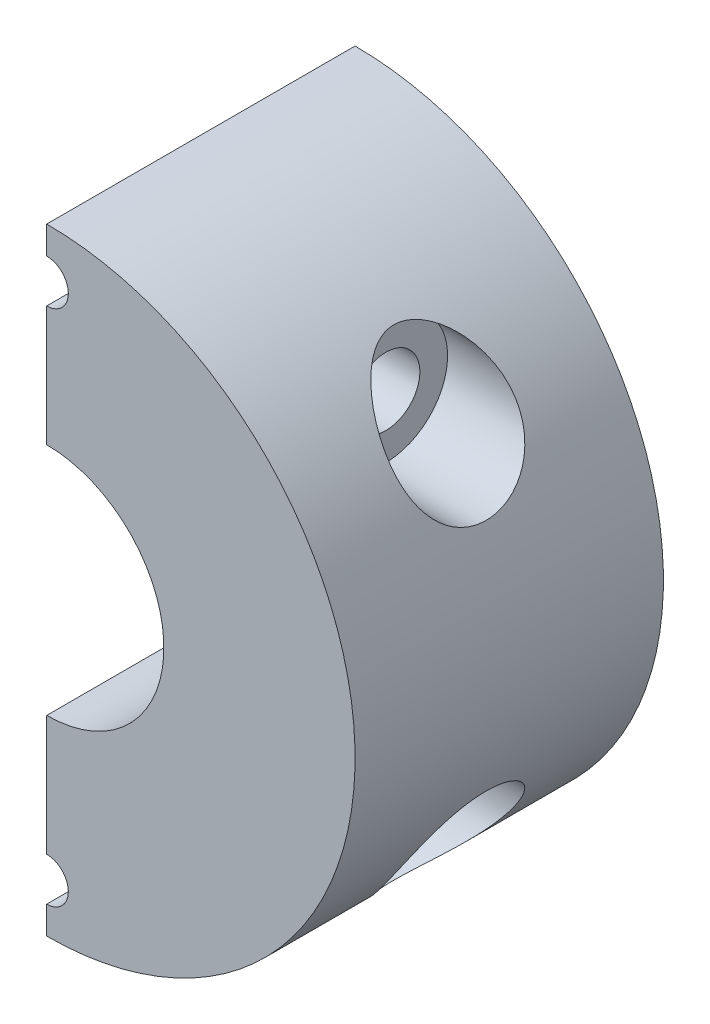
ISO-10303-21;
HEADER;
FILE_DESCRIPTION(('STEP AP214'),'2;1');
FILE_NAME('part.step','',(''),(''),'','','');
FILE_SCHEMA(('AUTOMOTIVE_DESIGN { 1 0 10303 214 1 1 1 1 }'));
ENDSEC;
DATA;
#1=APPLICATION_CONTEXT('core data for automotive mechanical design processes');
#2=APPLICATION_PROTOCOL_DEFINITION('international standard','automotive_design',2000,#1);
#3=PRODUCT_CONTEXT('',#1,'mechanical');
#4=PRODUCT('Part','Part','',(#3));
#5=PRODUCT_RELATED_PRODUCT_CATEGORY('part','',(#4));
#6=PRODUCT_DEFINITION_FORMATION('','',#4);
#7=PRODUCT_DEFINITION_CONTEXT('part definition',#1,'design');
#8=PRODUCT_DEFINITION('design','',#6,#7);
#9=PRODUCT_DEFINITION_SHAPE('','',#8);
#10=(LENGTH_UNIT() NAMED_UNIT(*) SI_UNIT(.MILLI.,.METRE.));
#11=(NAMED_UNIT(*) PLANE_ANGLE_UNIT() SI_UNIT($,.RADIAN.));
#12=(NAMED_UNIT(*) SI_UNIT($,.STERADIAN.) SOLID_ANGLE_UNIT());
#13=UNCERTAINTY_MEASURE_WITH_UNIT(LENGTH_MEASURE(1.E-05),#10,'distance_accuracy_value','');
#14=(GEOMETRIC_REPRESENTATION_CONTEXT(3) GLOBAL_UNCERTAINTY_ASSIGNED_CONTEXT((#13)) GLOBAL_UNIT_ASSIGNED_CONTEXT((#10,
#11,#12)) REPRESENTATION_CONTEXT('',''));
#15=CARTESIAN_POINT('',(0.,0.,0.));
#16=DIRECTION('',(0.,0.,1.));
#17=DIRECTION('',(1.,0.,0.));
#18=AXIS2_PLACEMENT_3D('',#15,#16,#17);
#19=CARTESIAN_POINT('',(0.,21.,0.));
#20=DIRECTION('',(0.,0.,1.));
#21=DIRECTION('',(1.,0.,0.));
#22=AXIS2_PLACEMENT_3D('',#19,#20,#21);
#23=CYLINDRICAL_SURFACE('',#22,1.75);
#24=CARTESIAN_POINT('',(0.,21.,5.));
#25=DIRECTION('',(0.,0.,-1.));
#26=DIRECTION('',(-1.,0.,0.));
#27=AXIS2_PLACEMENT_3D('',#24,#25,#26);
#28=CIRCLE('',#27,1.75);
#29=CARTESIAN_POINT('',(0.,19.25,5.));
#30=VERTEX_POINT('',#29);
#31=CARTESIAN_POINT('',(0.,22.75,5.));
#32=VERTEX_POINT('',#31);
#33=EDGE_CURVE('E249',#30,#32,#28,.F.);
#34=ORIENTED_EDGE('',*,*,#33,.F.);
#35=DIRECTION('',(0.,0.,1.));
#36=VECTOR('',#35,1.);
#37=CARTESIAN_POINT('',(0.,19.25,0.));
#38=LINE('',#37,#36);
#39=CARTESIAN_POINT('',(0.,19.25,25.));
#40=VERTEX_POINT('',#39);
#41=EDGE_CURVE('E226',#40,#30,#38,.F.);
#42=ORIENTED_EDGE('',*,*,#41,.F.);
#43=CARTESIAN_POINT('',(0.,21.,25.));
#44=DIRECTION('',(0.,0.,1.));
#45=DIRECTION('',(1.,0.,0.));
#46=AXIS2_PLACEMENT_3D('',#43,#44,#45);
#47=CIRCLE('',#46,1.75);
#48=CARTESIAN_POINT('',(0.,22.75,25.));
#49=VERTEX_POINT('',#48);
#50=EDGE_CURVE('E196',#40,#49,#47,.T.);
#51=ORIENTED_EDGE('',*,*,#50,.T.);
#52=DIRECTION('',(0.,0.,1.));
#53=VECTOR('',#52,1.);
#54=CARTESIAN_POINT('',(0.,22.75,0.));
#55=LINE('',#54,#53);
#56=EDGE_CURVE('E229',#32,#49,#55,.T.);
#57=ORIENTED_EDGE('',*,*,#56,.F.);
#58=EDGE_LOOP('',(#34,#42,#51,#57));
#59=FACE_BOUND('',#58,.T.);
#60=ADVANCED_FACE('F33',(#59),#23,.F.);
#61=CARTESIAN_POINT('',(0.,25.,0.));
#62=DIRECTION('',(1.,0.,0.));
#63=DIRECTION('',(0.,0.,-1.));
#64=AXIS2_PLACEMENT_3D('',#61,#62,#63);
#65=PLANE('',#64);
#66=CARTESIAN_POINT('',(0.,-14.5,12.5));
#67=DIRECTION('',(-1.,0.,0.));
#68=DIRECTION('',(0.,0.,1.));
#69=AXIS2_PLACEMENT_3D('',#66,#67,#68);
#70=CIRCLE('',#69,2.75);
#71=CARTESIAN_POINT('',(0.,-14.5,15.25));
#72=VERTEX_POINT('',#71);
#73=EDGE_CURVE('E181',#72,#72,#70,.T.);
#74=ORIENTED_EDGE('',*,*,#73,.F.);
#75=EDGE_LOOP('',(#74));
#76=FACE_BOUND('',#75,.T.);
#77=DIRECTION('',(0.,1.,0.));
#78=VECTOR('',#77,1.);
#79=CARTESIAN_POINT('',(0.,25.,0.));
#80=LINE('',#79,#78);
#81=CARTESIAN_POINT('',(0.,-17.5,0.));
#82=VERTEX_POINT('',#81);
#83=CARTESIAN_POINT('',(0.,-6.,0.));
#84=VERTEX_POINT('',#83);
#85=EDGE_CURVE('E157',#82,#84,#80,.T.);
#86=ORIENTED_EDGE('',*,*,#85,.F.);
#87=DIRECTION('',(0.,0.,-1.));
#88=VECTOR('',#87,1.);
#89=CARTESIAN_POINT('',(0.,-17.5,5.));
#90=LINE('',#89,#88);
#91=CARTESIAN_POINT('',(0.,-17.5,5.));
#92=VERTEX_POINT('',#91);
#93=EDGE_CURVE('E140',#82,#92,#90,.F.);
#94=ORIENTED_EDGE('',*,*,#93,.T.);
#95=DIRECTION('',(0.,-1.,0.));
#96=VECTOR('',#95,1.);
#97=CARTESIAN_POINT('',(0.,25.,5.));
#98=LINE('',#97,#96);
#99=CARTESIAN_POINT('',(0.,-19.25,5.));
#100=VERTEX_POINT('',#99);
#101=EDGE_CURVE('E212',#92,#100,#98,.T.);
#102=ORIENTED_EDGE('',*,*,#101,.T.);
#103=DIRECTION('',(0.,0.,1.));
#104=VECTOR('',#103,1.);
#105=CARTESIAN_POINT('',(0.,-19.25,0.));
#106=LINE('',#105,#104);
#107=CARTESIAN_POINT('',(0.,-19.25,25.));
#108=VERTEX_POINT('',#107);
#109=EDGE_CURVE('E245',#100,#108,#106,.T.);
#110=ORIENTED_EDGE('',*,*,#109,.T.);
#111=DIRECTION('',(0.,1.,0.));
#112=VECTOR('',#111,1.);
#113=CARTESIAN_POINT('',(0.,25.,25.));
#114=LINE('',#113,#112);
#115=CARTESIAN_POINT('',(0.,-9.5,25.));
#116=VERTEX_POINT('',#115);
#117=EDGE_CURVE('E172',#108,#116,#114,.T.);
#118=ORIENTED_EDGE('',*,*,#117,.T.);
#119=DIRECTION('',(0.,0.,1.));
#120=VECTOR('',#119,1.);
#121=CARTESIAN_POINT('',(0.,-9.5,5.));
#122=LINE('',#121,#120);
#123=CARTESIAN_POINT('',(0.,-9.5,5.));
#124=VERTEX_POINT('',#123);
#125=EDGE_CURVE('E486',#124,#116,#122,.T.);
#126=ORIENTED_EDGE('',*,*,#125,.F.);
#127=DIRECTION('',(0.,1.,0.));
#128=VECTOR('',#127,1.);
#129=CARTESIAN_POINT('',(0.,0.,5.));
#130=LINE('',#129,#128);
#131=CARTESIAN_POINT('',(0.,-6.,5.));
#132=VERTEX_POINT('',#131);
#133=EDGE_CURVE('E485',#124,#132,#130,.T.);
#134=ORIENTED_EDGE('',*,*,#133,.T.);
#135=DIRECTION('',(0.,0.,1.));
#136=VECTOR('',#135,1.);
#137=CARTESIAN_POINT('',(0.,-6.,-15.));
#138=LINE('',#137,#136);
#139=EDGE_CURVE('E235',#84,#132,#138,.T.);
#140=ORIENTED_EDGE('',*,*,#139,.F.);
#141=EDGE_LOOP('',(#86,#94,#102,#110,#118,#126,#134,#140));
#142=FACE_BOUND('',#141,.T.);
#143=ADVANCED_FACE('F299',(#76,#142),#65,.F.);
#144=CARTESIAN_POINT('',(0.,24.5,0.));
#145=VERTEX_POINT('',#144);
#146=CARTESIAN_POINT('',(0.,25.,0.));
#147=VERTEX_POINT('',#146);
#148=EDGE_CURVE('E163',#145,#147,#80,.T.);
#149=ORIENTED_EDGE('',*,*,#148,.F.);
#150=DIRECTION('',(0.,0.,-1.));
#151=VECTOR('',#150,1.);
#152=CARTESIAN_POINT('',(0.,24.5,5.));
#153=LINE('',#152,#151);
#154=CARTESIAN_POINT('',(0.,24.5,5.));
#155=VERTEX_POINT('',#154);
#156=EDGE_CURVE('E206',#145,#155,#153,.F.);
#157=ORIENTED_EDGE('',*,*,#156,.T.);
#158=DIRECTION('',(0.,1.,0.));
#159=VECTOR('',#158,1.);
#160=CARTESIAN_POINT('',(0.,25.,5.));
#161=LINE('',#160,#159);
#162=EDGE_CURVE('E209',#32,#155,#161,.T.);
#163=ORIENTED_EDGE('',*,*,#162,.F.);
#164=ORIENTED_EDGE('',*,*,#56,.T.);
#165=CARTESIAN_POINT('',(0.,25.,25.));
#166=VERTEX_POINT('',#165);
#167=EDGE_CURVE('E175',#49,#166,#114,.T.);
#168=ORIENTED_EDGE('',*,*,#167,.T.);
#169=DIRECTION('',(0.,0.,1.));
#170=VECTOR('',#169,1.);
#171=CARTESIAN_POINT('',(0.,25.,0.));
#172=LINE('',#171,#170);
#173=EDGE_CURVE('E156',#147,#166,#172,.T.);
#174=ORIENTED_EDGE('',*,*,#173,.F.);
#175=EDGE_LOOP('',(#149,#157,#163,#164,#168,#174));
#176=FACE_BOUND('',#175,.T.);
#177=ADVANCED_FACE('F251',(#176),#65,.F.);
#178=CARTESIAN_POINT('',(0.,0.,25.));
#179=DIRECTION('',(0.,0.,-1.));
#180=DIRECTION('',(-1.,0.,0.));
#181=AXIS2_PLACEMENT_3D('',#178,#179,#180);
#182=CYLINDRICAL_SURFACE('',#181,25.);
#183=CARTESIAN_POINT('',(20.3654118544163,14.5,17.5));
#184=CARTESIAN_POINT('',(20.242620103465,14.6724612822737,17.5000000653577));
#185=CARTESIAN_POINT('',(20.1175978881926,14.843408011226,17.4910758490451));
#186=CARTESIAN_POINT('',(19.8640534899469,15.1810412450875,17.4563109312045));
#187=CARTESIAN_POINT('',(19.7355289095989,15.3477246723567,17.4304583484866));
#188=CARTESIAN_POINT('',(19.4755389864491,15.6763330071527,17.3625591032278));
#189=CARTESIAN_POINT('',(19.3440652077939,15.8382400276103,17.3204582750635));
#190=CARTESIAN_POINT('',(19.0795941657325,16.1558594337865,17.2207873676544));
#191=CARTESIAN_POINT('',(18.9465971850649,16.3115729458979,17.1632201161412));
#192=CARTESIAN_POINT('',(18.6759075974207,16.6208908751804,17.0311126550394));
#193=CARTESIAN_POINT('',(18.5381978203011,16.7742783417187,16.9560994152901));
#194=CARTESIAN_POINT('',(18.2633947279486,17.0730669886588,16.7905138293489));
#195=CARTESIAN_POINT('',(18.1263015383728,17.2184666033719,16.6999384471001));
#196=CARTESIAN_POINT('',(17.8543561014628,17.5002931078029,16.5034625189679));
#197=CARTESIAN_POINT('',(17.7195010302117,17.6367320684608,16.397583231579));
#198=CARTESIAN_POINT('',(17.4535840407378,17.8999262806936,16.1702498553025));
#199=CARTESIAN_POINT('',(17.3225205635373,18.0266855484253,16.048802282424));
#200=CARTESIAN_POINT('',(17.107558346254,18.2303534138596,15.8315070380605));
#201=CARTESIAN_POINT('',(17.0220465346346,18.3101839992513,15.7399868668634));
#202=CARTESIAN_POINT('',(16.8546463463967,18.4643952568398,15.5493626540083));
#203=CARTESIAN_POINT('',(16.7727586765405,18.5387748678533,15.4502571432904));
#204=CARTESIAN_POINT('',(16.534265118929,18.7526875028186,15.1414556186223));
#205=CARTESIAN_POINT('',(16.3844218362518,18.8833763244251,14.9198747184233));
#206=CARTESIAN_POINT('',(16.1506640280272,19.0833230434094,14.5076787271961));
#207=CARTESIAN_POINT('',(16.0598069619284,19.159679115729,14.3244554899301));
#208=CARTESIAN_POINT('',(15.9006513914191,19.2919671664351,13.94148742213));
#209=CARTESIAN_POINT('',(15.8323175521316,19.3479311510208,13.7417690910481));
#210=CARTESIAN_POINT('',(15.7338167975318,19.4280829493581,13.3631638115392));
#211=CARTESIAN_POINT('',(15.6992293840184,19.4559760211531,13.1862293900877));
#212=CARTESIAN_POINT('',(15.6538356562987,19.4925196174792,12.8273951150641));
#213=CARTESIAN_POINT('',(15.6430114202075,19.50118464361,12.6454991083551));
#214=CARTESIAN_POINT('',(15.6462926088762,19.4985519371359,12.2819175173892));
#215=CARTESIAN_POINT('',(15.6604208286188,19.4872359511466,12.1002322774185));
#216=CARTESIAN_POINT('',(15.7121227854543,19.4455716423479,11.7424719763767));
#217=CARTESIAN_POINT('',(15.7497155466459,19.4152078762703,11.5664015894681));
#218=CARTESIAN_POINT('',(15.8572827852613,19.327505987429,11.1793600601289));
#219=CARTESIAN_POINT('',(15.9331220698859,19.2652185970709,10.9711593031344));
#220=CARTESIAN_POINT('',(16.1085427568584,19.1187847793872,10.5733405151265));
#221=CARTESIAN_POINT('',(16.2081713270784,19.0345948951286,10.3837604715947));
#222=CARTESIAN_POINT('',(16.4728799582761,18.8065566365564,9.9426530231433));
#223=CARTESIAN_POINT('',(16.647216828863,18.6529247641317,9.70173589454555));
#224=CARTESIAN_POINT('',(16.92359885645,18.4012949426208,9.36962684580795));
#225=CARTESIAN_POINT('',(17.0183444608446,18.3137546713544,9.26367771683618));
#226=CARTESIAN_POINT('',(17.2116543523714,18.1321940918762,9.0611558420719));
#227=CARTESIAN_POINT('',(17.3102185546913,18.0381739275488,8.96458288819828));
#228=CARTESIAN_POINT('',(17.5446487650671,17.810683065989,8.74876433987725));
#229=CARTESIAN_POINT('',(17.6816184682799,17.6748207032266,8.63323965057165));
#230=CARTESIAN_POINT('',(17.9584487341707,17.3934785116365,8.41844325456193));
#231=CARTESIAN_POINT('',(18.0983101973051,17.2479956551423,8.31917669895699));
#232=CARTESIAN_POINT('',(18.3793398989252,16.9482182211285,8.13685692954982));
#233=CARTESIAN_POINT('',(18.5205088153,16.7939188301327,8.05381268393962));
#234=CARTESIAN_POINT('',(18.8026799255918,16.477383852695,7.90428633266718));
#235=CARTESIAN_POINT('',(18.9436821365017,16.315149162404,7.83780236195936));
#236=CARTESIAN_POINT('',(19.2254247628275,15.9822080271571,7.72146474981612));
#237=CARTESIAN_POINT('',(19.3661541879252,15.8114444916228,7.67174750274144));
#238=CARTESIAN_POINT('',(19.6450479887721,15.4635631778839,7.59047348439134));
#239=CARTESIAN_POINT('',(19.7832121143204,15.2864447847618,7.5589184756179));
#240=CARTESIAN_POINT('',(20.0556062769372,14.9272698047635,7.51500994663268));
#241=CARTESIAN_POINT('',(20.1898417889937,14.7452208449726,7.5026283202129));
#242=CARTESIAN_POINT('',(20.4534126484517,14.3773798074809,7.49812325331996));
#243=CARTESIAN_POINT('',(20.5827495011275,14.1915889069398,7.505993537685));
#244=CARTESIAN_POINT('',(20.8054910335264,13.8622229376346,7.53877197754548));
#245=CARTESIAN_POINT('',(20.9001627578857,13.7190497622933,7.55921309625781));
#246=CARTESIAN_POINT('',(21.0854460082269,13.4325368681083,7.61310314717218));
#247=CARTESIAN_POINT('',(21.1760583911485,13.289197191031,7.64654931939844));
#248=CARTESIAN_POINT('',(21.352718519671,13.0034469223382,7.72691318697205));
#249=CARTESIAN_POINT('',(21.438765842307,12.8610364178813,7.77383212803323));
#250=CARTESIAN_POINT('',(21.6057301248615,12.5785266078964,7.88147480251725));
#251=CARTESIAN_POINT('',(21.6866496523292,12.4384261721069,7.94219155623385));
#252=CARTESIAN_POINT('',(21.8435486068727,12.1607982297298,8.07821069923306));
#253=CARTESIAN_POINT('',(21.9194824584775,12.0233009508381,8.15362779547267));
#254=CARTESIAN_POINT('',(22.0651790973477,11.7537793540694,8.31870488751859));
#255=CARTESIAN_POINT('',(22.1349449340929,11.6217523490282,8.4083577831161));
#256=CARTESIAN_POINT('',(22.2679190402953,11.3648887903474,8.60167881173974));
#257=CARTESIAN_POINT('',(22.3311289763411,11.2400504128795,8.70534336732426));
#258=CARTESIAN_POINT('',(22.4506624769467,10.9993550251621,8.92618588406788));
#259=CARTESIAN_POINT('',(22.5069872188467,10.8834964806409,9.04336152820799));
#260=CARTESIAN_POINT('',(22.6055254038911,10.6771496561979,9.27408734014332));
#261=CARTESIAN_POINT('',(22.6486201562659,10.5853310822094,9.38607512739105));
#262=CARTESIAN_POINT('',(22.7293058343104,10.4109503219156,9.61888620384471));
#263=CARTESIAN_POINT('',(22.7668974566218,10.3283869643021,9.73970837179689));
#264=CARTESIAN_POINT('',(22.836482889516,10.1736056462083,9.98925089500947));
#265=CARTESIAN_POINT('',(22.8684792685734,10.1013829416659,10.1179675894711));
#266=CARTESIAN_POINT('',(22.9268505503403,9.96819021721853,10.3823128152437));
#267=CARTESIAN_POINT('',(22.953225846624,9.90721940952392,10.5179408618147));
#268=CARTESIAN_POINT('',(22.9980728066099,9.80263054397983,10.7816110402454));
#269=CARTESIAN_POINT('',(23.0170605702284,9.75790768238272,10.9091286968258));
#270=CARTESIAN_POINT('',(23.0504328711058,9.67881138329842,11.167917699066));
#271=CARTESIAN_POINT('',(23.0648177250545,9.64443723380795,11.2991887858048));
#272=CARTESIAN_POINT('',(23.0889890622801,9.58642648120725,11.5644647427919));
#273=CARTESIAN_POINT('',(23.0987766386885,9.56278732559585,11.6984689552478));
#274=CARTESIAN_POINT('',(23.1137668491851,9.52649826561428,11.9682119128729));
#275=CARTESIAN_POINT('',(23.1189695342016,9.51384823917882,12.1039506387586));
#276=CARTESIAN_POINT('',(23.1246817127785,9.4999551570489,12.3707822033027));
#277=CARTESIAN_POINT('',(23.1253666664105,9.49828564653401,12.5018493024139));
#278=CARTESIAN_POINT('',(23.122508673669,9.50524104013825,12.7637091605465));
#279=CARTESIAN_POINT('',(23.1189643127029,9.51386938861599,12.8945018131119));
#280=CARTESIAN_POINT('',(23.1076442225258,9.54133104298121,13.1547653346803));
#281=CARTESIAN_POINT('',(23.0998704129937,9.56015971908715,13.2842367762199));
#282=CARTESIAN_POINT('',(23.0800823347369,9.60783350449831,13.5410420382977));
#283=CARTESIAN_POINT('',(23.0680665003661,9.63668231196906,13.6683750513832));
#284=CARTESIAN_POINT('',(23.039871581725,9.70389797631732,13.9192129030645));
#285=CARTESIAN_POINT('',(23.0237175515949,9.74220750600672,14.0427359346601));
#286=CARTESIAN_POINT('',(22.9872023656078,9.8280568860298,14.2859404338253));
#287=CARTESIAN_POINT('',(22.9668396925271,9.87560006473731,14.4056204979712));
#288=CARTESIAN_POINT('',(22.9219230798504,9.9794106721914,14.6402627653562));
#289=CARTESIAN_POINT('',(22.8973706732144,10.0356749093469,14.7552266751492));
#290=CARTESIAN_POINT('',(22.8440763143434,10.1564034256156,14.9798040475942));
#291=CARTESIAN_POINT('',(22.8153327997095,10.2208707616077,15.0894154944757));
#292=CARTESIAN_POINT('',(22.7530624707744,10.3587637038099,15.304789823554));
#293=CARTESIAN_POINT('',(22.7194494932694,10.4323461862573,15.410427317301));
#294=CARTESIAN_POINT('',(22.6479473171594,10.5866763087679,15.6148525988647));
#295=CARTESIAN_POINT('',(22.6100565707175,10.6674265400841,15.7136378863217));
#296=CARTESIAN_POINT('',(22.5301055696513,10.8352654327475,15.9037915506408));
#297=CARTESIAN_POINT('',(22.4880467282224,10.9223519431312,15.9951624223845));
#298=CARTESIAN_POINT('',(22.399845499838,11.1021147093449,16.1701662178363));
#299=CARTESIAN_POINT('',(22.3537015875534,11.1947930489655,16.2537962271308));
#300=CARTESIAN_POINT('',(22.2547890624386,11.3902151557258,16.417444052735));
#301=CARTESIAN_POINT('',(22.2017944408107,11.493232001806,16.496999686265));
#302=CARTESIAN_POINT('',(22.0916082196785,11.7036315962619,16.6469310549768));
#303=CARTESIAN_POINT('',(22.0344150682187,11.8110159524478,16.7173033686419));
#304=CARTESIAN_POINT('',(21.8568252016097,12.1383927073874,16.9144777789328));
#305=CARTESIAN_POINT('',(21.7303946865563,12.3636554757012,17.0273758770476));
#306=CARTESIAN_POINT('',(21.4495785877833,12.8452855219643,17.2261955098446));
#307=CARTESIAN_POINT('',(21.2936505970999,13.1024224439976,17.3080000967585));
#308=CARTESIAN_POINT('',(20.9679332191399,13.617580055577,17.4286118160402));
#309=CARTESIAN_POINT('',(20.798158681699,13.8755995212672,17.4674643781344));
#310=CARTESIAN_POINT('',(20.580767925929,14.1928736463883,17.4909442727506));
#311=CARTESIAN_POINT('',(20.5381014623803,14.2545441531627,17.4943510657389));
#312=CARTESIAN_POINT('',(20.4521872429737,14.3775398062722,17.498878531858));
#313=CARTESIAN_POINT('',(20.4089396883398,14.4388650622303,17.4999999768317));
#314=CARTESIAN_POINT('',(20.3654118544163,14.5,17.5));
#315=B_SPLINE_CURVE_WITH_KNOTS('',3,(#183,#184,#185,#186,#187,#188,#189,#190,#191,#192,#193,
#194,#195,#196,#197,#198,#199,#200,#201,#202,#203,#204,#205,#206,#207,#208,#209,#210,#211,#212,
#213,#214,#215,#216,#217,#218,#219,#220,#221,#222,#223,#224,#225,#226,#227,#228,#229,#230,#231,
#232,#233,#234,#235,#236,#237,#238,#239,#240,#241,#242,#243,#244,#245,#246,#247,#248,#249,#250,
#251,#252,#253,#254,#255,#256,#257,#258,#259,#260,#261,#262,#263,#264,#265,#266,#267,#268,#269,
#270,#271,#272,#273,#274,#275,#276,#277,#278,#279,#280,#281,#282,#283,#284,#285,#286,#287,#288,
#289,#290,#291,#292,#293,#294,#295,#296,#297,#298,#299,#300,#301,#302,#303,#304,#305,#306,#307,
#308,#309,#310,#311,#312,#313,#314),.UNSPECIFIED.,.T.,.F.,(4,2,2,2,2,2,2,2,2,2,2,2,2,2,2,2,2,2,
2,2,2,2,2,2,2,2,2,2,2,2,2,2,2,2,2,2,2,2,2,2,2,2,2,2,2,2,2,2,2,2,2,2,2,2,2,2,2,2,2,2,2,2,2,2,2,
4),(0.,0.635048423217999,1.27054303418833,1.90817470721101,2.54568988105144,3.20307228799824,
3.8605830912421,4.51718917751774,5.173521337248,5.6187830248981,6.0641311660786,
6.95278430959185,7.60556173121892,8.25731013376048,8.80221193436839,9.34670263561292,
9.89169100638015,10.4371218065801,11.1238066234677,11.8118644289495,12.8101591003705,
13.3106675498453,13.8111648892281,14.4848831622898,15.1588144797457,15.8331173192877,
16.5073441833568,17.1869304377811,17.8665826295773,18.545237574798,19.2236822605137,
19.7417604827578,20.2597288166722,20.7777450581997,21.2954998391201,21.8174692563372,
22.339179150527,22.8607560930529,23.3822437229127,23.8349088316998,24.2875165879233,
24.7399160277901,25.1922837813645,25.6011562834127,26.0100006481304,26.4187477493703,
26.8274903102619,27.2202595998438,27.6131602970811,28.0058828115894,28.3987504238801,
28.7892934836405,29.1799775812457,29.5705190387482,29.9612064598126,30.3599230338715,
30.7587843418526,31.1575108753285,31.5563869227821,31.9775272987276,32.398824137658,
33.2412252078224,34.1727371850547,35.1032629703052,35.3284541787073,35.5535693194643),.UNSPECIFIED.);
#316=CARTESIAN_POINT('',(20.3654118544163,14.5,17.5));
#317=VERTEX_POINT('',#316);
#318=EDGE_CURVE('E190',#317,#317,#315,.T.);
#319=ORIENTED_EDGE('',*,*,#318,.T.);
#320=EDGE_LOOP('',(#319));
#321=FACE_BOUND('',#320,.T.);
#322=CARTESIAN_POINT('',(20.3654118544163,-14.5,17.5));
#323=CARTESIAN_POINT('',(20.4892142698879,-14.326116274896,17.4999994158321));
#324=CARTESIAN_POINT('',(20.6108142363862,-14.1506028401532,17.490928721174));
#325=CARTESIAN_POINT('',(20.8486403673723,-13.7978072037332,17.4536254957486));
#326=CARTESIAN_POINT('',(20.9648633279923,-13.6205240221288,17.4253816939115));
#327=CARTESIAN_POINT('',(21.1909012738715,-13.2661178439004,17.3487534288791));
#328=CARTESIAN_POINT('',(21.3007146542959,-13.0889948982326,17.3003639460511));
#329=CARTESIAN_POINT('',(21.5128625574501,-12.737301901494,17.1826528754696));
#330=CARTESIAN_POINT('',(21.6152012896752,-12.5627304585041,17.1133431840097));
#331=CARTESIAN_POINT('',(21.7826413924718,-12.2693171250486,16.9768307714145));
#332=CARTESIAN_POINT('',(21.8498528066587,-12.1491636150805,16.9149859451968));
#333=CARTESIAN_POINT('',(21.979780391658,-11.9124916419966,16.7805733355605));
#334=CARTESIAN_POINT('',(22.0424975809512,-11.7959723586944,16.7080079931094));
#335=CARTESIAN_POINT('',(22.1631271391904,-11.5677333212955,16.5522696259378));
#336=CARTESIAN_POINT('',(22.2210421730204,-11.4560109220651,16.4691025503977));
#337=CARTESIAN_POINT('',(22.3318351547425,-11.2385065176405,16.2923979287831));
#338=CARTESIAN_POINT('',(22.384715422973,-11.1327217853112,16.1988652032865));
#339=CARTESIAN_POINT('',(22.4855342944351,-10.9276655802662,16.001258202498));
#340=CARTESIAN_POINT('',(22.5334446315832,-10.8284324181415,15.8971296626514));
#341=CARTESIAN_POINT('',(22.6238115291461,-10.6383376238649,15.6793774958029));
#342=CARTESIAN_POINT('',(22.6662703928191,-10.5474724608354,15.5657579124994));
#343=CARTESIAN_POINT('',(22.7456468486978,-10.3751892353203,15.3297154294766));
#344=CARTESIAN_POINT('',(22.7825634179986,-10.293772917374,15.2072909108397));
#345=CARTESIAN_POINT('',(22.8507677938986,-10.1414682729569,14.9545795382298));
#346=CARTESIAN_POINT('',(22.8820560793058,-10.0705790510172,14.8242933543229));
#347=CARTESIAN_POINT('',(22.9365188785745,-9.9458698308187,14.5684246766286));
#348=CARTESIAN_POINT('',(22.9601595820747,-9.89110650903417,14.4434000547123));
#349=CARTESIAN_POINT('',(23.0026963441151,-9.79177628578222,14.1885865897174));
#350=CARTESIAN_POINT('',(23.0215927172698,-9.74720870821391,14.0587980632059));
#351=CARTESIAN_POINT('',(23.0546386336626,-9.66878739381693,13.7954740479712));
#352=CARTESIAN_POINT('',(23.0687894885291,-9.63493069672182,13.6619396056689));
#353=CARTESIAN_POINT('',(23.0923592978472,-9.57830283445386,13.3921300340413));
#354=CARTESIAN_POINT('',(23.1017783632423,-9.55553140937123,13.2558549690517));
#355=CARTESIAN_POINT('',(23.1155520043124,-9.52216170798985,12.9882794545069));
#356=CARTESIAN_POINT('',(23.1201293381238,-9.51102831114438,12.8570568763706));
#357=CARTESIAN_POINT('',(23.1250121443685,-9.49915025896187,12.5940171751883));
#358=CARTESIAN_POINT('',(23.1253161939544,-9.49840906384796,12.4621998687325));
#359=CARTESIAN_POINT('',(23.1216498338638,-9.50733042176555,12.1990424388878));
#360=CARTESIAN_POINT('',(23.1176815007796,-9.51698792051067,12.0677021147816));
#361=CARTESIAN_POINT('',(23.105467326617,-9.54660335928079,11.8063397390005));
#362=CARTESIAN_POINT('',(23.0972199107382,-9.56656509148571,11.6763181906385));
#363=CARTESIAN_POINT('',(23.0765653374613,-9.61628026589872,11.4201384765238));
#364=CARTESIAN_POINT('',(23.064209612195,-9.64591256094721,11.2939526181776));
#365=CARTESIAN_POINT('',(23.0353036845578,-9.71474016059648,11.0446597649221));
#366=CARTESIAN_POINT('',(23.0187519711025,-9.75393891013618,10.9215538967824));
#367=CARTESIAN_POINT('',(22.981460525464,-9.84148020822065,10.6793493933429));
#368=CARTESIAN_POINT('',(22.9607224463289,-9.8898191471514,10.560249197932));
#369=CARTESIAN_POINT('',(22.9150509295666,-9.99518568474155,10.3267393642033));
#370=CARTESIAN_POINT('',(22.8901159304292,-10.0522165165657,10.2123314914923));
#371=CARTESIAN_POINT('',(22.8356898403383,-10.1752570637647,9.98737857206854));
#372=CARTESIAN_POINT('',(22.8061390991661,-10.2413827444138,9.87691141269861));
#373=CARTESIAN_POINT('',(22.7427718770144,-10.3813403756108,9.66220660001242));
#374=CARTESIAN_POINT('',(22.7089538545368,-10.455175109279,9.55797121799669));
#375=CARTESIAN_POINT('',(22.6371298444655,-10.6097885338985,9.35637368006142));
#376=CARTESIAN_POINT('',(22.5991250791261,-10.6905651967558,9.25900953173843));
#377=CARTESIAN_POINT('',(22.5189909057846,-10.8583468401774,9.07156109451986));
#378=CARTESIAN_POINT('',(22.4768599517925,-10.9453541519183,8.98147955750932));
#379=CARTESIAN_POINT('',(22.3865274142248,-11.1289860338346,8.80497281701997));
#380=CARTESIAN_POINT('',(22.3381341437418,-11.225870026437,8.71891522661018));
#381=CARTESIAN_POINT('',(22.2371152239679,-11.4246739810049,8.55551627548872));
#382=CARTESIAN_POINT('',(22.1844880354606,-11.526595769192,8.47817810943426));
#383=CARTESIAN_POINT('',(22.020541161654,-11.8385267079988,8.25961001738411));
#384=CARTESIAN_POINT('',(21.9030946299452,-12.0548279993252,8.13170646854457));
#385=CARTESIAN_POINT('',(21.6421975575324,-12.5176787400035,7.90180859536494));
#386=CARTESIAN_POINT('',(21.4973432668847,-12.7651676241053,7.80334419756547));
#387=CARTESIAN_POINT('',(21.1930704954333,-13.2642114104881,7.6480741720866));
#388=CARTESIAN_POINT('',(21.0336439732965,-13.5157684939205,7.59129170355005));
#389=CARTESIAN_POINT('',(20.6791162322041,-14.0531905985252,7.51156333443922));
#390=CARTESIAN_POINT('',(20.4821932588955,-14.3387444543876,7.49471345749868));
#391=CARTESIAN_POINT('',(20.077159214711,-14.9005942345336,7.50815110168993));
#392=CARTESIAN_POINT('',(19.8690452091604,-15.1768876992846,7.53845104590325));
#393=CARTESIAN_POINT('',(19.5333144866549,-15.6041737824435,7.6207861387905));
#394=CARTESIAN_POINT('',(19.4079195211662,-15.7598230743074,7.6586921143047));
#395=CARTESIAN_POINT('',(19.1555560603345,-16.0656125251668,7.74876319321921));
#396=CARTESIAN_POINT('',(19.0285878408234,-16.2157536321055,7.80092582990716));
#397=CARTESIAN_POINT('',(18.7736194391826,-16.5102776755094,7.91916625547382));
#398=CARTESIAN_POINT('',(18.6456174218446,-16.6546444407405,7.98528025692976));
#399=CARTESIAN_POINT('',(18.3899021844749,-16.9365789292695,8.1309892220642));
#400=CARTESIAN_POINT('',(18.2621888877167,-17.0741487304106,8.21058003250607));
#401=CARTESIAN_POINT('',(17.9917602933685,-17.3591451027683,8.39419881412654));
#402=CARTESIAN_POINT('',(17.849222985859,-17.5055711000308,8.50005204406085));
#403=CARTESIAN_POINT('',(17.5676044598199,-17.7881724488535,8.72892536195189));
#404=CARTESIAN_POINT('',(17.4285247864201,-17.9243432708952,8.85195296784117));
#405=CARTESIAN_POINT('',(17.1566619733438,-18.18472563519,9.11518562398023));
#406=CARTESIAN_POINT('',(17.0238603805969,-18.3089734959861,9.25533534782708));
#407=CARTESIAN_POINT('',(16.7673424149193,-18.5441758096165,9.55369977975767));
#408=CARTESIAN_POINT('',(16.6436161018728,-18.6551448934022,9.7118942230031));
#409=CARTESIAN_POINT('',(16.4083811514408,-18.8623907257041,10.0486793020225));
#410=CARTESIAN_POINT('',(16.2969819496771,-18.9585384562305,10.2274277119642));
#411=CARTESIAN_POINT('',(16.0937556109098,-19.1313567951947,10.6043826657106));
#412=CARTESIAN_POINT('',(16.0018965792696,-19.208059183359,10.8025567171467));
#413=CARTESIAN_POINT('',(15.8583033346393,-19.326703279213,11.1825452305694));
#414=CARTESIAN_POINT('',(15.8024420783367,-19.3722993236016,11.3616268283599));
#415=CARTESIAN_POINT('',(15.7143991984305,-19.4437890420052,11.7293395452356));
#416=CARTESIAN_POINT('',(15.6821954398221,-19.4697011339749,11.9179615607706));
#417=CARTESIAN_POINT('',(15.644846890325,-19.4997281593743,12.3007061630811));
#418=CARTESIAN_POINT('',(15.6398475773186,-19.5037259049724,12.4948527524648));
#419=CARTESIAN_POINT('',(15.6579321765388,-19.4892091277854,12.8809789138304));
#420=CARTESIAN_POINT('',(15.6810225809058,-19.4706894007266,13.0729579744978));
#421=CARTESIAN_POINT('',(15.7497051465378,-19.415161287606,13.4337501809374));
#422=CARTESIAN_POINT('',(15.7933661982023,-19.3797367551993,13.6031927026599));
#423=CARTESIAN_POINT('',(15.8985849576127,-19.2935128104109,13.9322052713237));
#424=CARTESIAN_POINT('',(15.9601506330522,-19.2427065526307,14.0917708845405));
#425=CARTESIAN_POINT('',(16.1366383876669,-19.0952453873172,14.4875356468387));
#426=CARTESIAN_POINT('',(16.261967582679,-18.9889661030568,14.7155521193323));
#427=CARTESIAN_POINT('',(16.4668608895743,-18.8109234610942,15.0359371387865));
#428=CARTESIAN_POINT('',(16.5381212135866,-18.7483402803291,15.1392947115296));
#429=CARTESIAN_POINT('',(16.6851993134617,-18.6175662813271,15.3389903681455));
#430=CARTESIAN_POINT('',(16.7610160053193,-18.5493767954759,15.4353301096592));
#431=CARTESIAN_POINT('',(16.9512050195422,-18.3760667485834,15.6630411223069));
#432=CARTESIAN_POINT('',(17.0675545672895,-18.2681519870695,15.7906331034403));
#433=CARTESIAN_POINT('',(17.3054659088588,-18.0429408549067,16.031970612161));
#434=CARTESIAN_POINT('',(17.4270300041463,-17.9256403216215,16.1457099389936));
#435=CARTESIAN_POINT('',(17.6736977947485,-17.6824894808723,16.3597960758739));
#436=CARTESIAN_POINT('',(17.7988053216611,-17.556629694739,16.4601276611705));
#437=CARTESIAN_POINT('',(18.0509884168681,-17.2972408063185,16.6474120494367));
#438=CARTESIAN_POINT('',(18.1780636697789,-17.1637129239551,16.7343669724576));
#439=CARTESIAN_POINT('',(18.4366751146001,-16.8856766773339,16.8971847475329));
#440=CARTESIAN_POINT('',(18.568235133282,-16.7409637149234,16.972660310061));
#441=CARTESIAN_POINT('',(18.8311479843063,-16.4446678509427,17.1092166102071));
#442=CARTESIAN_POINT('',(18.9625007781617,-16.2930838002151,17.1702949292837));
#443=CARTESIAN_POINT('',(19.2236067517328,-15.9841712261335,17.2774349418614));
#444=CARTESIAN_POINT('',(19.3533634571627,-15.8268605695718,17.3235395215529));
#445=CARTESIAN_POINT('',(19.6106858718282,-15.5068730081266,17.4003325262696));
#446=CARTESIAN_POINT('',(19.7382526383355,-15.3441988101911,17.4310286047003));
#447=CARTESIAN_POINT('',(19.9493313037849,-15.0679733702291,17.4689058074763));
#448=CARTESIAN_POINT('',(20.0336801913625,-14.9556492489713,17.4804876227257));
#449=CARTESIAN_POINT('',(20.2008119159111,-14.7291220134474,17.4960392455445));
#450=CARTESIAN_POINT('',(20.2835928638783,-14.614916908566,17.500000386067));
#451=CARTESIAN_POINT('',(20.3654118544163,-14.5,17.5));
#452=B_SPLINE_CURVE_WITH_KNOTS('',3,(#322,#323,#324,#325,#326,#327,#328,#329,#330,#331,#332,
#333,#334,#335,#336,#337,#338,#339,#340,#341,#342,#343,#344,#345,#346,#347,#348,#349,#350,#351,
#352,#353,#354,#355,#356,#357,#358,#359,#360,#361,#362,#363,#364,#365,#366,#367,#368,#369,#370,
#371,#372,#373,#374,#375,#376,#377,#378,#379,#380,#381,#382,#383,#384,#385,#386,#387,#388,#389,
#390,#391,#392,#393,#394,#395,#396,#397,#398,#399,#400,#401,#402,#403,#404,#405,#406,#407,#408,
#409,#410,#411,#412,#413,#414,#415,#416,#417,#418,#419,#420,#421,#422,#423,#424,#425,#426,#427,
#428,#429,#430,#431,#432,#433,#434,#435,#436,#437,#438,#439,#440,#441,#442,#443,#444,#445,#446,
#447,#448,#449,#450,#451),.UNSPECIFIED.,.T.,.F.,(4,2,2,2,2,2,2,2,2,2,2,2,2,2,2,2,2,2,2,2,2,2,2,
2,2,2,2,2,2,2,2,2,2,2,2,2,2,2,2,2,2,2,2,2,2,2,2,2,2,2,2,2,2,2,2,2,2,2,2,2,2,2,2,2,4),(0.,
0.640214281696645,1.28080524494261,1.92155591774025,2.56194291141289,3.01428010335431,
3.4665144603647,3.91849615330278,4.37026852586503,4.82448367359086,5.27850627856318,
5.73261257677258,6.18668022507609,6.60172903544915,7.0167503150932,7.43165679100477,
7.84655353838282,8.24139909533533,8.63637611829765,9.03116124925494,9.42609177333895,
9.81625344490114,10.2065558239262,10.5967043867116,10.9869984307248,11.3828327847255,
11.7788105401294,12.174673000825,12.570684353879,12.9852027010566,13.3998724309268,
14.2286630247144,15.1347666194183,16.0413732794173,17.0793634621014,18.1176271817773,
18.7274365871445,19.3371405489462,19.9484469831627,20.5595653687999,21.2491064820793,
21.9389503879913,22.6266214119532,23.3135276232002,24.0061113435367,24.6975557622437,
25.2743930156252,25.8506898646664,26.4300654992415,27.0095750654828,27.5430959355293,
28.0768545906624,28.9149617400891,29.3355573860414,29.7560533612357,30.366054384905,
30.9763274627597,31.5872877335876,32.1981510740667,32.8264444321204,33.4548432598296,
34.0814260888573,34.7076973853536,35.1303241550513,35.5534312976455),.UNSPECIFIED.);
#453=CARTESIAN_POINT('',(20.3654118544163,-14.5,17.5));
#454=VERTEX_POINT('',#453);
#455=EDGE_CURVE('E275',#454,#454,#452,.T.);
#456=ORIENTED_EDGE('',*,*,#455,.T.);
#457=EDGE_LOOP('',(#456));
#458=FACE_BOUND('',#457,.T.);
#459=CARTESIAN_POINT('',(0.,0.,25.));
#460=DIRECTION('',(0.,0.,1.));
#461=DIRECTION('',(1.,0.,0.));
#462=AXIS2_PLACEMENT_3D('',#459,#460,#461);
#463=CIRCLE('',#462,25.);
#464=CARTESIAN_POINT('',(0.,-25.,25.));
#465=VERTEX_POINT('',#464);
#466=EDGE_CURVE('E256',#465,#166,#463,.T.);
#467=ORIENTED_EDGE('',*,*,#466,.F.);
#468=DIRECTION('',(0.,0.,1.));
#469=VECTOR('',#468,1.);
#470=CARTESIAN_POINT('',(0.,-25.,0.));
#471=LINE('',#470,#469);
#472=CARTESIAN_POINT('',(0.,-25.,0.));
#473=VERTEX_POINT('',#472);
#474=EDGE_CURVE('E161',#473,#465,#471,.T.);
#475=ORIENTED_EDGE('',*,*,#474,.F.);
#476=CARTESIAN_POINT('',(0.,0.,0.));
#477=DIRECTION('',(0.,0.,1.));
#478=DIRECTION('',(1.,0.,0.));
#479=AXIS2_PLACEMENT_3D('',#476,#477,#478);
#480=CIRCLE('',#479,25.);
#481=EDGE_CURVE('E155',#473,#147,#480,.T.);
#482=ORIENTED_EDGE('',*,*,#481,.T.);
#483=ORIENTED_EDGE('',*,*,#173,.T.);
#484=EDGE_LOOP('',(#467,#475,#482,#483));
#485=FACE_BOUND('',#484,.T.);
#486=ADVANCED_FACE('F35',(#321,#458,#485),#182,.T.);
#487=CARTESIAN_POINT('',(0.,0.,25.));
#488=DIRECTION('',(0.,0.,1.));
#489=DIRECTION('',(1.,0.,0.));
#490=AXIS2_PLACEMENT_3D('',#487,#488,#489);
#491=PLANE('',#490);
#492=ORIENTED_EDGE('',*,*,#50,.F.);
#493=CARTESIAN_POINT('',(0.,9.5,25.));
#494=VERTEX_POINT('',#493);
#495=EDGE_CURVE('E173',#494,#40,#114,.T.);
#496=ORIENTED_EDGE('',*,*,#495,.F.);
#497=CARTESIAN_POINT('',(0.,0.,25.));
#498=DIRECTION('',(0.,0.,1.));
#499=DIRECTION('',(1.,0.,0.));
#500=AXIS2_PLACEMENT_3D('',#497,#498,#499);
#501=CIRCLE('',#500,9.5);
#502=EDGE_CURVE('E265',#116,#494,#501,.T.);
#503=ORIENTED_EDGE('',*,*,#502,.F.);
#504=ORIENTED_EDGE('',*,*,#117,.F.);
#505=CARTESIAN_POINT('',(0.,-21.,25.));
#506=DIRECTION('',(0.,0.,1.));
#507=DIRECTION('',(1.,0.,0.));
#508=AXIS2_PLACEMENT_3D('',#505,#506,#507);
#509=CIRCLE('',#508,1.75);
#510=CARTESIAN_POINT('',(0.,-22.75,25.));
#511=VERTEX_POINT('',#510);
#512=EDGE_CURVE('E200',#511,#108,#509,.T.);
#513=ORIENTED_EDGE('',*,*,#512,.F.);
#514=EDGE_CURVE('E168',#465,#511,#114,.T.);
#515=ORIENTED_EDGE('',*,*,#514,.F.);
#516=ORIENTED_EDGE('',*,*,#466,.T.);
#517=ORIENTED_EDGE('',*,*,#167,.F.);
#518=EDGE_LOOP('',(#492,#496,#503,#504,#513,#515,#516,#517));
#519=FACE_BOUND('',#518,.T.);
#520=ADVANCED_FACE('F254',(#519),#491,.T.);
#521=CARTESIAN_POINT('',(0.,0.,0.));
#522=DIRECTION('',(0.,0.,1.));
#523=DIRECTION('',(1.,0.,0.));
#524=AXIS2_PLACEMENT_3D('',#521,#522,#523);
#525=PLANE('',#524);
#526=CARTESIAN_POINT('',(0.,6.,0.));
#527=VERTEX_POINT('',#526);
#528=CARTESIAN_POINT('',(0.,17.5,0.));
#529=VERTEX_POINT('',#528);
#530=EDGE_CURVE('E159',#527,#529,#80,.T.);
#531=ORIENTED_EDGE('',*,*,#530,.T.);
#532=CARTESIAN_POINT('',(0.,21.,0.));
#533=DIRECTION('',(0.,0.,-1.));
#534=DIRECTION('',(-1.,0.,0.));
#535=AXIS2_PLACEMENT_3D('',#532,#533,#534);
#536=CIRCLE('',#535,3.5);
#537=EDGE_CURVE('E218',#145,#529,#536,.T.);
#538=ORIENTED_EDGE('',*,*,#537,.F.);
#539=ORIENTED_EDGE('',*,*,#148,.T.);
#540=ORIENTED_EDGE('',*,*,#481,.F.);
#541=CARTESIAN_POINT('',(0.,-24.5,0.));
#542=VERTEX_POINT('',#541);
#543=EDGE_CURVE('E148',#473,#542,#80,.T.);
#544=ORIENTED_EDGE('',*,*,#543,.T.);
#545=CARTESIAN_POINT('',(0.,-21.,0.));
#546=DIRECTION('',(0.,0.,-1.));
#547=DIRECTION('',(1.,0.,0.));
#548=AXIS2_PLACEMENT_3D('',#545,#546,#547);
#549=CIRCLE('',#548,3.5);
#550=EDGE_CURVE('E136',#82,#542,#549,.T.);
#551=ORIENTED_EDGE('',*,*,#550,.F.);
#552=ORIENTED_EDGE('',*,*,#85,.T.);
#553=CARTESIAN_POINT('',(0.,0.,0.));
#554=DIRECTION('',(0.,0.,1.));
#555=DIRECTION('',(1.,0.,0.));
#556=AXIS2_PLACEMENT_3D('',#553,#554,#555);
#557=CIRCLE('',#556,6.);
#558=EDGE_CURVE('E268',#84,#527,#557,.T.);
#559=ORIENTED_EDGE('',*,*,#558,.T.);
#560=EDGE_LOOP('',(#531,#538,#539,#540,#544,#551,#552,#559));
#561=FACE_BOUND('',#560,.T.);
#562=ADVANCED_FACE('F153',(#561),#525,.F.);
#563=CARTESIAN_POINT('',(0.,0.,5.));
#564=DIRECTION('',(0.,0.,1.));
#565=DIRECTION('',(1.,0.,0.));
#566=AXIS2_PLACEMENT_3D('',#563,#564,#565);
#567=CYLINDRICAL_SURFACE('',#566,9.5);
#568=ORIENTED_EDGE('',*,*,#502,.T.);
#569=DIRECTION('',(0.,0.,1.));
#570=VECTOR('',#569,1.);
#571=CARTESIAN_POINT('',(0.,9.5,5.));
#572=LINE('',#571,#570);
#573=CARTESIAN_POINT('',(0.,9.5,5.));
#574=VERTEX_POINT('',#573);
#575=EDGE_CURVE('E492',#494,#574,#572,.F.);
#576=ORIENTED_EDGE('',*,*,#575,.T.);
#577=CARTESIAN_POINT('',(0.,0.,5.));
#578=DIRECTION('',(0.,0.,1.));
#579=DIRECTION('',(1.,0.,0.));
#580=AXIS2_PLACEMENT_3D('',#577,#578,#579);
#581=CIRCLE('',#580,9.5);
#582=EDGE_CURVE('E262',#124,#574,#581,.T.);
#583=ORIENTED_EDGE('',*,*,#582,.F.);
#584=ORIENTED_EDGE('',*,*,#125,.T.);
#585=EDGE_LOOP('',(#568,#576,#583,#584));
#586=FACE_BOUND('',#585,.T.);
#587=ADVANCED_FACE('F307',(#586),#567,.F.);
#588=CARTESIAN_POINT('',(0.,0.,5.));
#589=DIRECTION('',(0.,0.,1.));
#590=DIRECTION('',(1.,0.,0.));
#591=AXIS2_PLACEMENT_3D('',#588,#589,#590);
#592=PLANE('',#591);
#593=ORIENTED_EDGE('',*,*,#133,.F.);
#594=ORIENTED_EDGE('',*,*,#582,.T.);
#595=CARTESIAN_POINT('',(0.,6.,5.));
#596=VERTEX_POINT('',#595);
#597=EDGE_CURVE('E488',#596,#574,#130,.T.);
#598=ORIENTED_EDGE('',*,*,#597,.F.);
#599=CARTESIAN_POINT('',(0.,0.,5.));
#600=DIRECTION('',(0.,0.,1.));
#601=DIRECTION('',(1.,0.,0.));
#602=AXIS2_PLACEMENT_3D('',#599,#600,#601);
#603=CIRCLE('',#602,6.);
#604=EDGE_CURVE('E269',#132,#596,#603,.T.);
#605=ORIENTED_EDGE('',*,*,#604,.F.);
#606=EDGE_LOOP('',(#593,#594,#598,#605));
#607=FACE_BOUND('',#606,.T.);
#608=ADVANCED_FACE('F303',(#607),#592,.T.);
#609=CARTESIAN_POINT('',(0.,0.,-15.));
#610=DIRECTION('',(0.,0.,1.));
#611=DIRECTION('',(1.,0.,0.));
#612=AXIS2_PLACEMENT_3D('',#609,#610,#611);
#613=CYLINDRICAL_SURFACE('',#612,6.);
#614=ORIENTED_EDGE('',*,*,#604,.T.);
#615=DIRECTION('',(0.,0.,1.));
#616=VECTOR('',#615,1.);
#617=CARTESIAN_POINT('',(0.,6.,-15.));
#618=LINE('',#617,#616);
#619=EDGE_CURVE('E230',#596,#527,#618,.F.);
#620=ORIENTED_EDGE('',*,*,#619,.T.);
#621=ORIENTED_EDGE('',*,*,#558,.F.);
#622=ORIENTED_EDGE('',*,*,#139,.T.);
#623=EDGE_LOOP('',(#614,#620,#621,#622));
#624=FACE_BOUND('',#623,.T.);
#625=ADVANCED_FACE('F300',(#624),#613,.F.);
#626=DIRECTION('',(0.,-1.,0.));
#627=VECTOR('',#626,1.);
#628=CARTESIAN_POINT('',(0.,25.,5.));
#629=LINE('',#628,#627);
#630=CARTESIAN_POINT('',(0.,-22.75,5.));
#631=VERTEX_POINT('',#630);
#632=CARTESIAN_POINT('',(0.,-24.5,5.));
#633=VERTEX_POINT('',#632);
#634=EDGE_CURVE('E57',#631,#633,#629,.T.);
#635=ORIENTED_EDGE('',*,*,#634,.T.);
#636=DIRECTION('',(0.,0.,-1.));
#637=VECTOR('',#636,1.);
#638=CARTESIAN_POINT('',(0.,-24.5,5.));
#639=LINE('',#638,#637);
#640=EDGE_CURVE('E11',#633,#542,#639,.T.);
#641=ORIENTED_EDGE('',*,*,#640,.T.);
#642=ORIENTED_EDGE('',*,*,#543,.F.);
#643=ORIENTED_EDGE('',*,*,#474,.T.);
#644=ORIENTED_EDGE('',*,*,#514,.T.);
#645=DIRECTION('',(0.,0.,1.));
#646=VECTOR('',#645,1.);
#647=CARTESIAN_POINT('',(0.,-22.75,0.));
#648=LINE('',#647,#646);
#649=EDGE_CURVE('E232',#511,#631,#648,.F.);
#650=ORIENTED_EDGE('',*,*,#649,.T.);
#651=EDGE_LOOP('',(#635,#641,#642,#643,#644,#650));
#652=FACE_BOUND('',#651,.T.);
#653=ADVANCED_FACE('F147',(#652),#65,.F.);
#654=CARTESIAN_POINT('',(0.,14.5,12.5));
#655=DIRECTION('',(-1.,0.,0.));
#656=DIRECTION('',(0.,0.,-1.));
#657=AXIS2_PLACEMENT_3D('',#654,#655,#656);
#658=CIRCLE('',#657,2.75);
#659=CARTESIAN_POINT('',(0.,14.5,9.75));
#660=VERTEX_POINT('',#659);
#661=EDGE_CURVE('E185',#660,#660,#658,.T.);
#662=ORIENTED_EDGE('',*,*,#661,.F.);
#663=EDGE_LOOP('',(#662));
#664=FACE_BOUND('',#663,.T.);
#665=DIRECTION('',(0.,1.,0.));
#666=VECTOR('',#665,1.);
#667=CARTESIAN_POINT('',(0.,25.,5.));
#668=LINE('',#667,#666);
#669=CARTESIAN_POINT('',(0.,17.5,5.));
#670=VERTEX_POINT('',#669);
#671=EDGE_CURVE('E49',#670,#30,#668,.T.);
#672=ORIENTED_EDGE('',*,*,#671,.F.);
#673=DIRECTION('',(0.,0.,-1.));
#674=VECTOR('',#673,1.);
#675=CARTESIAN_POINT('',(0.,17.5,5.));
#676=LINE('',#675,#674);
#677=EDGE_CURVE('E42',#670,#529,#676,.T.);
#678=ORIENTED_EDGE('',*,*,#677,.T.);
#679=ORIENTED_EDGE('',*,*,#530,.F.);
#680=ORIENTED_EDGE('',*,*,#619,.F.);
#681=ORIENTED_EDGE('',*,*,#597,.T.);
#682=ORIENTED_EDGE('',*,*,#575,.F.);
#683=ORIENTED_EDGE('',*,*,#495,.T.);
#684=ORIENTED_EDGE('',*,*,#41,.T.);
#685=EDGE_LOOP('',(#672,#678,#679,#680,#681,#682,#683,#684));
#686=FACE_BOUND('',#685,.T.);
#687=ADVANCED_FACE('F225',(#664,#686),#65,.F.);
#688=CARTESIAN_POINT('',(25.,14.5,12.5));
#689=DIRECTION('',(-1.,0.,0.));
#690=DIRECTION('',(0.,0.,1.));
#691=AXIS2_PLACEMENT_3D('',#688,#689,#690);
#692=CYLINDRICAL_SURFACE('',#691,2.75);
#693=CARTESIAN_POINT('',(15.,14.5,12.5));
#694=DIRECTION('',(-1.,0.,0.));
#695=DIRECTION('',(0.,0.,1.));
#696=AXIS2_PLACEMENT_3D('',#693,#694,#695);
#697=CIRCLE('',#696,2.75);
#698=CARTESIAN_POINT('',(15.,14.5,15.25));
#699=VERTEX_POINT('',#698);
#700=EDGE_CURVE('E273',#699,#699,#697,.F.);
#701=ORIENTED_EDGE('',*,*,#700,.T.);
#702=EDGE_LOOP('',(#701));
#703=FACE_BOUND('',#702,.T.);
#704=ORIENTED_EDGE('',*,*,#661,.T.);
#705=EDGE_LOOP('',(#704));
#706=FACE_BOUND('',#705,.T.);
#707=ADVANCED_FACE('F291',(#703,#706),#692,.F.);
#708=CARTESIAN_POINT('',(25.,-14.5,12.5));
#709=DIRECTION('',(-1.,0.,0.));
#710=DIRECTION('',(0.,0.,1.));
#711=AXIS2_PLACEMENT_3D('',#708,#709,#710);
#712=CYLINDRICAL_SURFACE('',#711,2.75);
#713=CARTESIAN_POINT('',(15.,-14.5,12.5));
#714=DIRECTION('',(-1.,0.,0.));
#715=DIRECTION('',(0.,0.,1.));
#716=AXIS2_PLACEMENT_3D('',#713,#714,#715);
#717=CIRCLE('',#716,2.75);
#718=CARTESIAN_POINT('',(15.,-14.5,15.25));
#719=VERTEX_POINT('',#718);
#720=EDGE_CURVE('E199',#719,#719,#717,.F.);
#721=ORIENTED_EDGE('',*,*,#720,.T.);
#722=EDGE_LOOP('',(#721));
#723=FACE_BOUND('',#722,.T.);
#724=ORIENTED_EDGE('',*,*,#73,.T.);
#725=EDGE_LOOP('',(#724));
#726=FACE_BOUND('',#725,.T.);
#727=ADVANCED_FACE('F287',(#723,#726),#712,.F.);
#728=CARTESIAN_POINT('',(35.,-14.5,12.5));
#729=DIRECTION('',(-1.,0.,0.));
#730=DIRECTION('',(0.,0.,1.));
#731=AXIS2_PLACEMENT_3D('',#728,#729,#730);
#732=CYLINDRICAL_SURFACE('',#731,5.);
#733=CARTESIAN_POINT('',(15.,-14.5,12.5));
#734=DIRECTION('',(-1.,0.,0.));
#735=DIRECTION('',(0.,0.,1.));
#736=AXIS2_PLACEMENT_3D('',#733,#734,#735);
#737=CIRCLE('',#736,5.);
#738=CARTESIAN_POINT('',(15.,-14.5,17.5));
#739=VERTEX_POINT('',#738);
#740=EDGE_CURVE('E192',#739,#739,#737,.T.);
#741=ORIENTED_EDGE('',*,*,#740,.T.);
#742=EDGE_LOOP('',(#741));
#743=FACE_BOUND('',#742,.T.);
#744=ORIENTED_EDGE('',*,*,#455,.F.);
#745=EDGE_LOOP('',(#744));
#746=FACE_BOUND('',#745,.T.);
#747=ADVANCED_FACE('F281',(#743,#746),#732,.F.);
#748=CARTESIAN_POINT('',(15.,-14.5,12.5));
#749=DIRECTION('',(-1.,0.,0.));
#750=DIRECTION('',(0.,0.,1.));
#751=AXIS2_PLACEMENT_3D('',#748,#749,#750);
#752=PLANE('',#751);
#753=ORIENTED_EDGE('',*,*,#740,.F.);
#754=EDGE_LOOP('',(#753));
#755=FACE_BOUND('',#754,.T.);
#756=ORIENTED_EDGE('',*,*,#720,.F.);
#757=EDGE_LOOP('',(#756));
#758=FACE_BOUND('',#757,.T.);
#759=ADVANCED_FACE('F286',(#755,#758),#752,.F.);
#760=CARTESIAN_POINT('',(35.,14.5,12.5));
#761=DIRECTION('',(-1.,0.,0.));
#762=DIRECTION('',(0.,0.,1.));
#763=AXIS2_PLACEMENT_3D('',#760,#761,#762);
#764=CYLINDRICAL_SURFACE('',#763,5.);
#765=CARTESIAN_POINT('',(15.,14.5,12.5));
#766=DIRECTION('',(-1.,0.,0.));
#767=DIRECTION('',(0.,0.,1.));
#768=AXIS2_PLACEMENT_3D('',#765,#766,#767);
#769=CIRCLE('',#768,5.);
#770=CARTESIAN_POINT('',(15.,14.5,17.5));
#771=VERTEX_POINT('',#770);
#772=EDGE_CURVE('E195',#771,#771,#769,.T.);
#773=ORIENTED_EDGE('',*,*,#772,.T.);
#774=EDGE_LOOP('',(#773));
#775=FACE_BOUND('',#774,.T.);
#776=ORIENTED_EDGE('',*,*,#318,.F.);
#777=EDGE_LOOP('',(#776));
#778=FACE_BOUND('',#777,.T.);
#779=ADVANCED_FACE('F331',(#775,#778),#764,.F.);
#780=CARTESIAN_POINT('',(15.,14.5,12.5));
#781=DIRECTION('',(-1.,0.,0.));
#782=DIRECTION('',(0.,0.,1.));
#783=AXIS2_PLACEMENT_3D('',#780,#781,#782);
#784=PLANE('',#783);
#785=ORIENTED_EDGE('',*,*,#772,.F.);
#786=EDGE_LOOP('',(#785));
#787=FACE_BOUND('',#786,.T.);
#788=ORIENTED_EDGE('',*,*,#700,.F.);
#789=EDGE_LOOP('',(#788));
#790=FACE_BOUND('',#789,.T.);
#791=ADVANCED_FACE('F328',(#787,#790),#784,.F.);
#792=CARTESIAN_POINT('',(0.,-21.,0.));
#793=DIRECTION('',(0.,0.,1.));
#794=DIRECTION('',(1.,0.,0.));
#795=AXIS2_PLACEMENT_3D('',#792,#793,#794);
#796=CYLINDRICAL_SURFACE('',#795,1.75);
#797=ORIENTED_EDGE('',*,*,#109,.F.);
#798=CARTESIAN_POINT('',(0.,-21.,5.));
#799=DIRECTION('',(0.,0.,1.));
#800=DIRECTION('',(1.,0.,0.));
#801=AXIS2_PLACEMENT_3D('',#798,#799,#800);
#802=CIRCLE('',#801,1.75);
#803=EDGE_CURVE('E247',#100,#631,#802,.F.);
#804=ORIENTED_EDGE('',*,*,#803,.T.);
#805=ORIENTED_EDGE('',*,*,#649,.F.);
#806=ORIENTED_EDGE('',*,*,#512,.T.);
#807=EDGE_LOOP('',(#797,#804,#805,#806));
#808=FACE_BOUND('',#807,.T.);
#809=ADVANCED_FACE('F325',(#808),#796,.F.);
#810=CARTESIAN_POINT('',(0.,-21.,5.));
#811=DIRECTION('',(0.,0.,-1.));
#812=DIRECTION('',(-1.,0.,0.));
#813=AXIS2_PLACEMENT_3D('',#810,#811,#812);
#814=CYLINDRICAL_SURFACE('',#813,3.5);
#815=ORIENTED_EDGE('',*,*,#550,.T.);
#816=ORIENTED_EDGE('',*,*,#640,.F.);
#817=CARTESIAN_POINT('',(0.,-21.,5.));
#818=DIRECTION('',(0.,0.,-1.));
#819=DIRECTION('',(1.,0.,0.));
#820=AXIS2_PLACEMENT_3D('',#817,#818,#819);
#821=CIRCLE('',#820,3.5);
#822=EDGE_CURVE('E144',#92,#633,#821,.T.);
#823=ORIENTED_EDGE('',*,*,#822,.F.);
#824=ORIENTED_EDGE('',*,*,#93,.F.);
#825=EDGE_LOOP('',(#815,#816,#823,#824));
#826=FACE_BOUND('',#825,.T.);
#827=ADVANCED_FACE('F137',(#826),#814,.F.);
#828=CARTESIAN_POINT('',(0.,-21.,5.));
#829=DIRECTION('',(0.,0.,1.));
#830=DIRECTION('',(1.,0.,0.));
#831=AXIS2_PLACEMENT_3D('',#828,#829,#830);
#832=PLANE('',#831);
#833=ORIENTED_EDGE('',*,*,#822,.T.);
#834=ORIENTED_EDGE('',*,*,#634,.F.);
#835=ORIENTED_EDGE('',*,*,#803,.F.);
#836=ORIENTED_EDGE('',*,*,#101,.F.);
#837=EDGE_LOOP('',(#833,#834,#835,#836));
#838=FACE_BOUND('',#837,.T.);
#839=ADVANCED_FACE('F458',(#838),#832,.F.);
#840=CARTESIAN_POINT('',(0.,21.,5.));
#841=DIRECTION('',(0.,0.,-1.));
#842=DIRECTION('',(-1.,0.,0.));
#843=AXIS2_PLACEMENT_3D('',#840,#841,#842);
#844=CYLINDRICAL_SURFACE('',#843,3.5);
#845=ORIENTED_EDGE('',*,*,#537,.T.);
#846=ORIENTED_EDGE('',*,*,#677,.F.);
#847=CARTESIAN_POINT('',(0.,21.,5.));
#848=DIRECTION('',(0.,0.,-1.));
#849=DIRECTION('',(-1.,0.,0.));
#850=AXIS2_PLACEMENT_3D('',#847,#848,#849);
#851=CIRCLE('',#850,3.5);
#852=EDGE_CURVE('E215',#155,#670,#851,.T.);
#853=ORIENTED_EDGE('',*,*,#852,.F.);
#854=ORIENTED_EDGE('',*,*,#156,.F.);
#855=EDGE_LOOP('',(#845,#846,#853,#854));
#856=FACE_BOUND('',#855,.T.);
#857=ADVANCED_FACE('F466',(#856),#844,.F.);
#858=CARTESIAN_POINT('',(0.,21.,5.));
#859=DIRECTION('',(0.,0.,-1.));
#860=DIRECTION('',(-1.,0.,0.));
#861=AXIS2_PLACEMENT_3D('',#858,#859,#860);
#862=PLANE('',#861);
#863=ORIENTED_EDGE('',*,*,#162,.T.);
#864=ORIENTED_EDGE('',*,*,#852,.T.);
#865=ORIENTED_EDGE('',*,*,#671,.T.);
#866=ORIENTED_EDGE('',*,*,#33,.T.);
#867=EDGE_LOOP('',(#863,#864,#865,#866));
#868=FACE_BOUND('',#867,.T.);
#869=ADVANCED_FACE('F221',(#868),#862,.T.);
#870=CLOSED_SHELL('',(#60,#143,#177,#486,#520,#562,#587,#608,#625,#653,#687,#707,#727,#747,#759,
#779,#791,#809,#827,#839,#857,#869));
#871=MANIFOLD_SOLID_BREP('B2',#870);
#872=ADVANCED_BREP_SHAPE_REPRESENTATION('',(#18,#871),#14);
#873=SHAPE_DEFINITION_REPRESENTATION(#9,#872);
ENDSEC;
END-ISO-10303-21;
